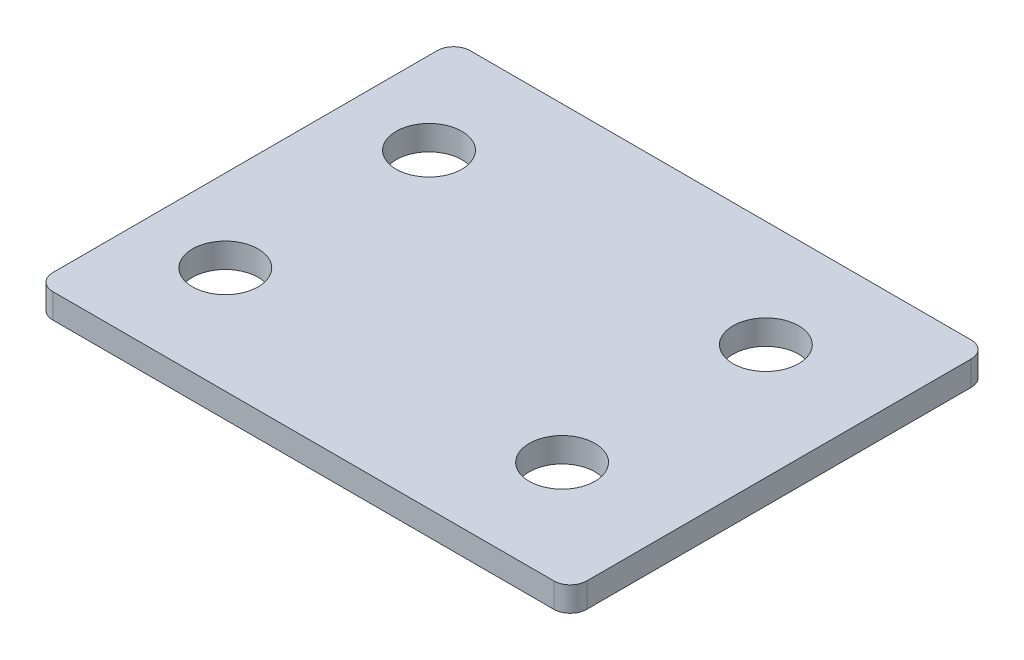
ISO-10303-21;
HEADER;
FILE_DESCRIPTION(('STEP AP214'),'2;1');
FILE_NAME('part.step','',(''),(''),'','','');
FILE_SCHEMA(('AUTOMOTIVE_DESIGN { 1 0 10303 214 1 1 1 1 }'));
ENDSEC;
DATA;
#1=APPLICATION_CONTEXT('core data for automotive mechanical design processes');
#2=APPLICATION_PROTOCOL_DEFINITION('international standard','automotive_design',2000,#1);
#3=PRODUCT_CONTEXT('',#1,'mechanical');
#4=PRODUCT('Part','Part','',(#3));
#5=PRODUCT_RELATED_PRODUCT_CATEGORY('part','',(#4));
#6=PRODUCT_DEFINITION_FORMATION('','',#4);
#7=PRODUCT_DEFINITION_CONTEXT('part definition',#1,'design');
#8=PRODUCT_DEFINITION('design','',#6,#7);
#9=PRODUCT_DEFINITION_SHAPE('','',#8);
#10=(LENGTH_UNIT() NAMED_UNIT(*) SI_UNIT(.MILLI.,.METRE.));
#11=(NAMED_UNIT(*) PLANE_ANGLE_UNIT() SI_UNIT($,.RADIAN.));
#12=(NAMED_UNIT(*) SI_UNIT($,.STERADIAN.) SOLID_ANGLE_UNIT());
#13=UNCERTAINTY_MEASURE_WITH_UNIT(LENGTH_MEASURE(1.E-05),#10,'distance_accuracy_value','');
#14=(GEOMETRIC_REPRESENTATION_CONTEXT(3) GLOBAL_UNCERTAINTY_ASSIGNED_CONTEXT((#13)) GLOBAL_UNIT_ASSIGNED_CONTEXT((#10,
#11,#12)) REPRESENTATION_CONTEXT('',''));
#15=CARTESIAN_POINT('',(0.,0.,0.));
#16=DIRECTION('',(0.,0.,1.));
#17=DIRECTION('',(1.,0.,0.));
#18=AXIS2_PLACEMENT_3D('',#15,#16,#17);
#19=CARTESIAN_POINT('',(-30.5,3.,23.4));
#20=DIRECTION('',(0.,1.,0.));
#21=DIRECTION('',(0.,0.,1.));
#22=AXIS2_PLACEMENT_3D('',#19,#20,#21);
#23=PLANE('',#22);
#24=CARTESIAN_POINT('',(-22.5,3.,12.4));
#25=DIRECTION('',(0.,1.,0.));
#26=DIRECTION('',(0.,0.,1.));
#27=AXIS2_PLACEMENT_3D('',#24,#25,#26);
#28=CIRCLE('',#27,4.);
#29=CARTESIAN_POINT('',(-22.5,3.,16.4));
#30=VERTEX_POINT('',#29);
#31=EDGE_CURVE('E188',#30,#30,#28,.T.);
#32=ORIENTED_EDGE('',*,*,#31,.F.);
#33=EDGE_LOOP('',(#32));
#34=FACE_BOUND('',#33,.T.);
#35=CARTESIAN_POINT('',(-22.5,3.,-12.4));
#36=DIRECTION('',(0.,1.,0.));
#37=DIRECTION('',(0.,0.,1.));
#38=AXIS2_PLACEMENT_3D('',#35,#36,#37);
#39=CIRCLE('',#38,4.);
#40=CARTESIAN_POINT('',(-22.5,3.,-8.4));
#41=VERTEX_POINT('',#40);
#42=EDGE_CURVE('E134',#41,#41,#39,.T.);
#43=ORIENTED_EDGE('',*,*,#42,.F.);
#44=EDGE_LOOP('',(#43));
#45=FACE_BOUND('',#44,.T.);
#46=CARTESIAN_POINT('',(-30.5,3.,23.4));
#47=DIRECTION('',(0.,1.,0.));
#48=DIRECTION('',(0.,0.,1.));
#49=AXIS2_PLACEMENT_3D('',#46,#47,#48);
#50=CIRCLE('',#49,2.);
#51=CARTESIAN_POINT('',(-32.5,3.,23.4));
#52=VERTEX_POINT('',#51);
#53=CARTESIAN_POINT('',(-30.5,3.,25.4));
#54=VERTEX_POINT('',#53);
#55=EDGE_CURVE('E145',#52,#54,#50,.T.);
#56=ORIENTED_EDGE('',*,*,#55,.T.);
#57=DIRECTION('',(1.,0.,0.));
#58=VECTOR('',#57,1.);
#59=CARTESIAN_POINT('',(-30.5,3.,25.4));
#60=LINE('',#59,#58);
#61=CARTESIAN_POINT('',(30.5,3.,25.4));
#62=VERTEX_POINT('',#61);
#63=EDGE_CURVE('E93',#54,#62,#60,.T.);
#64=ORIENTED_EDGE('',*,*,#63,.T.);
#65=CARTESIAN_POINT('',(30.5,3.,23.4));
#66=DIRECTION('',(0.,1.,0.));
#67=DIRECTION('',(0.,0.,1.));
#68=AXIS2_PLACEMENT_3D('',#65,#66,#67);
#69=CIRCLE('',#68,2.);
#70=CARTESIAN_POINT('',(32.5,3.,23.4));
#71=VERTEX_POINT('',#70);
#72=EDGE_CURVE('E160',#62,#71,#69,.T.);
#73=ORIENTED_EDGE('',*,*,#72,.T.);
#74=DIRECTION('',(0.,0.,-1.));
#75=VECTOR('',#74,1.);
#76=CARTESIAN_POINT('',(32.5,3.,23.4));
#77=LINE('',#76,#75);
#78=CARTESIAN_POINT('',(32.5,3.,-23.4));
#79=VERTEX_POINT('',#78);
#80=EDGE_CURVE('E173',#71,#79,#77,.T.);
#81=ORIENTED_EDGE('',*,*,#80,.T.);
#82=CARTESIAN_POINT('',(30.5,3.,-23.4));
#83=DIRECTION('',(0.,1.,0.));
#84=DIRECTION('',(0.,0.,1.));
#85=AXIS2_PLACEMENT_3D('',#82,#83,#84);
#86=CIRCLE('',#85,2.);
#87=CARTESIAN_POINT('',(30.5,3.,-25.4));
#88=VERTEX_POINT('',#87);
#89=EDGE_CURVE('E112',#79,#88,#86,.T.);
#90=ORIENTED_EDGE('',*,*,#89,.T.);
#91=DIRECTION('',(-1.,0.,0.));
#92=VECTOR('',#91,1.);
#93=CARTESIAN_POINT('',(-30.5,3.,-25.4));
#94=LINE('',#93,#92);
#95=CARTESIAN_POINT('',(-30.5,3.,-25.4));
#96=VERTEX_POINT('',#95);
#97=EDGE_CURVE('E106',#88,#96,#94,.T.);
#98=ORIENTED_EDGE('',*,*,#97,.T.);
#99=CARTESIAN_POINT('',(-30.5,3.,-23.4));
#100=DIRECTION('',(0.,1.,0.));
#101=DIRECTION('',(0.,0.,-1.));
#102=AXIS2_PLACEMENT_3D('',#99,#100,#101);
#103=CIRCLE('',#102,2.);
#104=CARTESIAN_POINT('',(-32.5,3.,-23.4));
#105=VERTEX_POINT('',#104);
#106=EDGE_CURVE('E110',#96,#105,#103,.T.);
#107=ORIENTED_EDGE('',*,*,#106,.T.);
#108=DIRECTION('',(0.,0.,1.));
#109=VECTOR('',#108,1.);
#110=CARTESIAN_POINT('',(-32.5,3.,23.4));
#111=LINE('',#110,#109);
#112=EDGE_CURVE('E50',#105,#52,#111,.T.);
#113=ORIENTED_EDGE('',*,*,#112,.T.);
#114=EDGE_LOOP('',(#56,#64,#73,#81,#90,#98,#107,#113));
#115=FACE_BOUND('',#114,.T.);
#116=CARTESIAN_POINT('',(18.5,3.,-12.4));
#117=DIRECTION('',(0.,1.,0.));
#118=DIRECTION('',(0.,0.,1.));
#119=AXIS2_PLACEMENT_3D('',#116,#117,#118);
#120=CIRCLE('',#119,4.);
#121=CARTESIAN_POINT('',(18.5,3.,-8.4));
#122=VERTEX_POINT('',#121);
#123=EDGE_CURVE('E182',#122,#122,#120,.T.);
#124=ORIENTED_EDGE('',*,*,#123,.F.);
#125=EDGE_LOOP('',(#124));
#126=FACE_BOUND('',#125,.T.);
#127=CARTESIAN_POINT('',(18.5,3.,12.4));
#128=DIRECTION('',(0.,1.,0.));
#129=DIRECTION('',(0.,0.,1.));
#130=AXIS2_PLACEMENT_3D('',#127,#128,#129);
#131=CIRCLE('',#130,4.);
#132=CARTESIAN_POINT('',(18.5,3.,16.4));
#133=VERTEX_POINT('',#132);
#134=EDGE_CURVE('E194',#133,#133,#131,.T.);
#135=ORIENTED_EDGE('',*,*,#134,.F.);
#136=EDGE_LOOP('',(#135));
#137=FACE_BOUND('',#136,.T.);
#138=ADVANCED_FACE('F33',(#34,#45,#115,#126,#137),#23,.T.);
#139=CARTESIAN_POINT('',(-30.5,0.,23.4));
#140=DIRECTION('',(0.,1.,0.));
#141=DIRECTION('',(0.,0.,1.));
#142=AXIS2_PLACEMENT_3D('',#139,#140,#141);
#143=PLANE('',#142);
#144=CARTESIAN_POINT('',(-30.5,0.,23.4));
#145=DIRECTION('',(0.,1.,0.));
#146=DIRECTION('',(0.,0.,1.));
#147=AXIS2_PLACEMENT_3D('',#144,#145,#146);
#148=CIRCLE('',#147,2.);
#149=CARTESIAN_POINT('',(-32.5,0.,23.4));
#150=VERTEX_POINT('',#149);
#151=CARTESIAN_POINT('',(-30.5,0.,25.4));
#152=VERTEX_POINT('',#151);
#153=EDGE_CURVE('E130',#150,#152,#148,.T.);
#154=ORIENTED_EDGE('',*,*,#153,.F.);
#155=DIRECTION('',(0.,0.,1.));
#156=VECTOR('',#155,1.);
#157=CARTESIAN_POINT('',(-32.5,0.,23.4));
#158=LINE('',#157,#156);
#159=CARTESIAN_POINT('',(-32.5,0.,-23.4));
#160=VERTEX_POINT('',#159);
#161=EDGE_CURVE('E85',#160,#150,#158,.T.);
#162=ORIENTED_EDGE('',*,*,#161,.F.);
#163=CARTESIAN_POINT('',(-30.5,0.,-23.4));
#164=DIRECTION('',(0.,1.,0.));
#165=DIRECTION('',(0.,0.,-1.));
#166=AXIS2_PLACEMENT_3D('',#163,#164,#165);
#167=CIRCLE('',#166,2.);
#168=CARTESIAN_POINT('',(-30.5,0.,-25.4));
#169=VERTEX_POINT('',#168);
#170=EDGE_CURVE('E79',#169,#160,#167,.T.);
#171=ORIENTED_EDGE('',*,*,#170,.F.);
#172=DIRECTION('',(-1.,0.,0.));
#173=VECTOR('',#172,1.);
#174=CARTESIAN_POINT('',(-30.5,0.,-25.4));
#175=LINE('',#174,#173);
#176=CARTESIAN_POINT('',(30.5,0.,-25.4));
#177=VERTEX_POINT('',#176);
#178=EDGE_CURVE('E120',#177,#169,#175,.T.);
#179=ORIENTED_EDGE('',*,*,#178,.F.);
#180=CARTESIAN_POINT('',(30.5,0.,-23.4));
#181=DIRECTION('',(0.,1.,0.));
#182=DIRECTION('',(0.,0.,1.));
#183=AXIS2_PLACEMENT_3D('',#180,#181,#182);
#184=CIRCLE('',#183,2.);
#185=CARTESIAN_POINT('',(32.5,0.,-23.4));
#186=VERTEX_POINT('',#185);
#187=EDGE_CURVE('E140',#186,#177,#184,.T.);
#188=ORIENTED_EDGE('',*,*,#187,.F.);
#189=DIRECTION('',(0.,0.,-1.));
#190=VECTOR('',#189,1.);
#191=CARTESIAN_POINT('',(32.5,0.,23.4));
#192=LINE('',#191,#190);
#193=CARTESIAN_POINT('',(32.5,0.,23.4));
#194=VERTEX_POINT('',#193);
#195=EDGE_CURVE('E138',#194,#186,#192,.T.);
#196=ORIENTED_EDGE('',*,*,#195,.F.);
#197=CARTESIAN_POINT('',(30.5,0.,23.4));
#198=DIRECTION('',(0.,1.,0.));
#199=DIRECTION('',(0.,0.,1.));
#200=AXIS2_PLACEMENT_3D('',#197,#198,#199);
#201=CIRCLE('',#200,2.);
#202=CARTESIAN_POINT('',(30.5,0.,25.4));
#203=VERTEX_POINT('',#202);
#204=EDGE_CURVE('E136',#203,#194,#201,.T.);
#205=ORIENTED_EDGE('',*,*,#204,.F.);
#206=DIRECTION('',(1.,0.,0.));
#207=VECTOR('',#206,1.);
#208=CARTESIAN_POINT('',(-30.5,0.,25.4));
#209=LINE('',#208,#207);
#210=EDGE_CURVE('E133',#152,#203,#209,.T.);
#211=ORIENTED_EDGE('',*,*,#210,.F.);
#212=EDGE_LOOP('',(#154,#162,#171,#179,#188,#196,#205,#211));
#213=FACE_BOUND('',#212,.T.);
#214=CARTESIAN_POINT('',(-22.5,0.,-12.4));
#215=DIRECTION('',(0.,1.,0.));
#216=DIRECTION('',(0.,0.,1.));
#217=AXIS2_PLACEMENT_3D('',#214,#215,#216);
#218=CIRCLE('',#217,4.);
#219=CARTESIAN_POINT('',(-22.5,0.,-8.4));
#220=VERTEX_POINT('',#219);
#221=EDGE_CURVE('E179',#220,#220,#218,.T.);
#222=ORIENTED_EDGE('',*,*,#221,.T.);
#223=EDGE_LOOP('',(#222));
#224=FACE_BOUND('',#223,.T.);
#225=CARTESIAN_POINT('',(18.5,0.,-12.4));
#226=DIRECTION('',(0.,1.,0.));
#227=DIRECTION('',(0.,0.,1.));
#228=AXIS2_PLACEMENT_3D('',#225,#226,#227);
#229=CIRCLE('',#228,4.);
#230=CARTESIAN_POINT('',(18.5,0.,-8.4));
#231=VERTEX_POINT('',#230);
#232=EDGE_CURVE('E185',#231,#231,#229,.T.);
#233=ORIENTED_EDGE('',*,*,#232,.T.);
#234=EDGE_LOOP('',(#233));
#235=FACE_BOUND('',#234,.T.);
#236=CARTESIAN_POINT('',(-22.5,0.,12.4));
#237=DIRECTION('',(0.,1.,0.));
#238=DIRECTION('',(0.,0.,1.));
#239=AXIS2_PLACEMENT_3D('',#236,#237,#238);
#240=CIRCLE('',#239,4.);
#241=CARTESIAN_POINT('',(-22.5,0.,16.4));
#242=VERTEX_POINT('',#241);
#243=EDGE_CURVE('E191',#242,#242,#240,.T.);
#244=ORIENTED_EDGE('',*,*,#243,.T.);
#245=EDGE_LOOP('',(#244));
#246=FACE_BOUND('',#245,.T.);
#247=CARTESIAN_POINT('',(18.5,0.,12.4));
#248=DIRECTION('',(0.,1.,0.));
#249=DIRECTION('',(0.,0.,1.));
#250=AXIS2_PLACEMENT_3D('',#247,#248,#249);
#251=CIRCLE('',#250,4.);
#252=CARTESIAN_POINT('',(18.5,0.,16.4));
#253=VERTEX_POINT('',#252);
#254=EDGE_CURVE('E197',#253,#253,#251,.T.);
#255=ORIENTED_EDGE('',*,*,#254,.T.);
#256=EDGE_LOOP('',(#255));
#257=FACE_BOUND('',#256,.T.);
#258=ADVANCED_FACE('F164',(#213,#224,#235,#246,#257),#143,.F.);
#259=CARTESIAN_POINT('',(-30.5,3.,23.4));
#260=DIRECTION('',(0.,-1.,0.));
#261=DIRECTION('',(0.,0.,-1.));
#262=AXIS2_PLACEMENT_3D('',#259,#260,#261);
#263=CYLINDRICAL_SURFACE('',#262,2.);
#264=ORIENTED_EDGE('',*,*,#153,.T.);
#265=DIRECTION('',(0.,-1.,0.));
#266=VECTOR('',#265,1.);
#267=CARTESIAN_POINT('',(-30.5,3.,25.4));
#268=LINE('',#267,#266);
#269=EDGE_CURVE('E11',#54,#152,#268,.T.);
#270=ORIENTED_EDGE('',*,*,#269,.F.);
#271=ORIENTED_EDGE('',*,*,#55,.F.);
#272=DIRECTION('',(0.,-1.,0.));
#273=VECTOR('',#272,1.);
#274=CARTESIAN_POINT('',(-32.5,3.,23.4));
#275=LINE('',#274,#273);
#276=EDGE_CURVE('E126',#52,#150,#275,.T.);
#277=ORIENTED_EDGE('',*,*,#276,.T.);
#278=EDGE_LOOP('',(#264,#270,#271,#277));
#279=FACE_BOUND('',#278,.T.);
#280=ADVANCED_FACE('F35',(#279),#263,.T.);
#281=CARTESIAN_POINT('',(-30.5,3.,25.4));
#282=DIRECTION('',(0.,0.,-1.));
#283=DIRECTION('',(-1.,0.,0.));
#284=AXIS2_PLACEMENT_3D('',#281,#282,#283);
#285=PLANE('',#284);
#286=ORIENTED_EDGE('',*,*,#210,.T.);
#287=DIRECTION('',(0.,-1.,0.));
#288=VECTOR('',#287,1.);
#289=CARTESIAN_POINT('',(30.5,3.,25.4));
#290=LINE('',#289,#288);
#291=EDGE_CURVE('E42',#62,#203,#290,.T.);
#292=ORIENTED_EDGE('',*,*,#291,.F.);
#293=ORIENTED_EDGE('',*,*,#63,.F.);
#294=ORIENTED_EDGE('',*,*,#269,.T.);
#295=EDGE_LOOP('',(#286,#292,#293,#294));
#296=FACE_BOUND('',#295,.T.);
#297=ADVANCED_FACE('F231',(#296),#285,.F.);
#298=CARTESIAN_POINT('',(30.5,3.,23.4));
#299=DIRECTION('',(0.,-1.,0.));
#300=DIRECTION('',(0.,0.,-1.));
#301=AXIS2_PLACEMENT_3D('',#298,#299,#300);
#302=CYLINDRICAL_SURFACE('',#301,2.);
#303=ORIENTED_EDGE('',*,*,#204,.T.);
#304=DIRECTION('',(0.,-1.,0.));
#305=VECTOR('',#304,1.);
#306=CARTESIAN_POINT('',(32.5,3.,23.4));
#307=LINE('',#306,#305);
#308=EDGE_CURVE('E152',#71,#194,#307,.T.);
#309=ORIENTED_EDGE('',*,*,#308,.F.);
#310=ORIENTED_EDGE('',*,*,#72,.F.);
#311=ORIENTED_EDGE('',*,*,#291,.T.);
#312=EDGE_LOOP('',(#303,#309,#310,#311));
#313=FACE_BOUND('',#312,.T.);
#314=ADVANCED_FACE('F158',(#313),#302,.T.);
#315=CARTESIAN_POINT('',(32.5,3.,23.4));
#316=DIRECTION('',(-1.,0.,0.));
#317=DIRECTION('',(0.,0.,1.));
#318=AXIS2_PLACEMENT_3D('',#315,#316,#317);
#319=PLANE('',#318);
#320=ORIENTED_EDGE('',*,*,#195,.T.);
#321=DIRECTION('',(0.,-1.,0.));
#322=VECTOR('',#321,1.);
#323=CARTESIAN_POINT('',(32.5,3.,-23.4));
#324=LINE('',#323,#322);
#325=EDGE_CURVE('E149',#79,#186,#324,.T.);
#326=ORIENTED_EDGE('',*,*,#325,.F.);
#327=ORIENTED_EDGE('',*,*,#80,.F.);
#328=ORIENTED_EDGE('',*,*,#308,.T.);
#329=EDGE_LOOP('',(#320,#326,#327,#328));
#330=FACE_BOUND('',#329,.T.);
#331=ADVANCED_FACE('F169',(#330),#319,.F.);
#332=CARTESIAN_POINT('',(30.5,3.,-23.4));
#333=DIRECTION('',(0.,-1.,0.));
#334=DIRECTION('',(0.,0.,-1.));
#335=AXIS2_PLACEMENT_3D('',#332,#333,#334);
#336=CYLINDRICAL_SURFACE('',#335,2.);
#337=ORIENTED_EDGE('',*,*,#187,.T.);
#338=DIRECTION('',(0.,-1.,0.));
#339=VECTOR('',#338,1.);
#340=CARTESIAN_POINT('',(30.5,3.,-25.4));
#341=LINE('',#340,#339);
#342=EDGE_CURVE('E121',#88,#177,#341,.T.);
#343=ORIENTED_EDGE('',*,*,#342,.F.);
#344=ORIENTED_EDGE('',*,*,#89,.F.);
#345=ORIENTED_EDGE('',*,*,#325,.T.);
#346=EDGE_LOOP('',(#337,#343,#344,#345));
#347=FACE_BOUND('',#346,.T.);
#348=ADVANCED_FACE('F172',(#347),#336,.T.);
#349=CARTESIAN_POINT('',(-30.5,3.,-25.4));
#350=DIRECTION('',(0.,0.,1.));
#351=DIRECTION('',(1.,0.,0.));
#352=AXIS2_PLACEMENT_3D('',#349,#350,#351);
#353=PLANE('',#352);
#354=ORIENTED_EDGE('',*,*,#178,.T.);
#355=DIRECTION('',(0.,-1.,0.));
#356=VECTOR('',#355,1.);
#357=CARTESIAN_POINT('',(-30.5,3.,-25.4));
#358=LINE('',#357,#356);
#359=EDGE_CURVE('E117',#96,#169,#358,.T.);
#360=ORIENTED_EDGE('',*,*,#359,.F.);
#361=ORIENTED_EDGE('',*,*,#97,.F.);
#362=ORIENTED_EDGE('',*,*,#342,.T.);
#363=EDGE_LOOP('',(#354,#360,#361,#362));
#364=FACE_BOUND('',#363,.T.);
#365=ADVANCED_FACE('F118',(#364),#353,.F.);
#366=CARTESIAN_POINT('',(-30.5,3.,-23.4));
#367=DIRECTION('',(0.,-1.,0.));
#368=DIRECTION('',(0.,0.,-1.));
#369=AXIS2_PLACEMENT_3D('',#366,#367,#368);
#370=CYLINDRICAL_SURFACE('',#369,2.);
#371=ORIENTED_EDGE('',*,*,#170,.T.);
#372=DIRECTION('',(0.,-1.,0.));
#373=VECTOR('',#372,1.);
#374=CARTESIAN_POINT('',(-32.5,3.,-23.4));
#375=LINE('',#374,#373);
#376=EDGE_CURVE('E122',#105,#160,#375,.T.);
#377=ORIENTED_EDGE('',*,*,#376,.F.);
#378=ORIENTED_EDGE('',*,*,#106,.F.);
#379=ORIENTED_EDGE('',*,*,#359,.T.);
#380=EDGE_LOOP('',(#371,#377,#378,#379));
#381=FACE_BOUND('',#380,.T.);
#382=ADVANCED_FACE('F124',(#381),#370,.T.);
#383=CARTESIAN_POINT('',(-32.5,3.,23.4));
#384=DIRECTION('',(1.,0.,0.));
#385=DIRECTION('',(0.,0.,-1.));
#386=AXIS2_PLACEMENT_3D('',#383,#384,#385);
#387=PLANE('',#386);
#388=ORIENTED_EDGE('',*,*,#161,.T.);
#389=ORIENTED_EDGE('',*,*,#276,.F.);
#390=ORIENTED_EDGE('',*,*,#112,.F.);
#391=ORIENTED_EDGE('',*,*,#376,.T.);
#392=EDGE_LOOP('',(#388,#389,#390,#391));
#393=FACE_BOUND('',#392,.T.);
#394=ADVANCED_FACE('F219',(#393),#387,.F.);
#395=CARTESIAN_POINT('',(-22.5,3.,-12.4));
#396=DIRECTION('',(0.,-1.,0.));
#397=DIRECTION('',(0.,0.,-1.));
#398=AXIS2_PLACEMENT_3D('',#395,#396,#397);
#399=CYLINDRICAL_SURFACE('',#398,4.);
#400=ORIENTED_EDGE('',*,*,#42,.T.);
#401=EDGE_LOOP('',(#400));
#402=FACE_BOUND('',#401,.T.);
#403=ORIENTED_EDGE('',*,*,#221,.F.);
#404=EDGE_LOOP('',(#403));
#405=FACE_BOUND('',#404,.T.);
#406=ADVANCED_FACE('F216',(#402,#405),#399,.F.);
#407=CARTESIAN_POINT('',(18.5,3.,-12.4));
#408=DIRECTION('',(0.,-1.,0.));
#409=DIRECTION('',(0.,0.,-1.));
#410=AXIS2_PLACEMENT_3D('',#407,#408,#409);
#411=CYLINDRICAL_SURFACE('',#410,4.);
#412=ORIENTED_EDGE('',*,*,#123,.T.);
#413=EDGE_LOOP('',(#412));
#414=FACE_BOUND('',#413,.T.);
#415=ORIENTED_EDGE('',*,*,#232,.F.);
#416=EDGE_LOOP('',(#415));
#417=FACE_BOUND('',#416,.T.);
#418=ADVANCED_FACE('F295',(#414,#417),#411,.F.);
#419=CARTESIAN_POINT('',(-22.5,3.,12.4));
#420=DIRECTION('',(0.,-1.,0.));
#421=DIRECTION('',(0.,0.,-1.));
#422=AXIS2_PLACEMENT_3D('',#419,#420,#421);
#423=CYLINDRICAL_SURFACE('',#422,4.);
#424=ORIENTED_EDGE('',*,*,#31,.T.);
#425=EDGE_LOOP('',(#424));
#426=FACE_BOUND('',#425,.T.);
#427=ORIENTED_EDGE('',*,*,#243,.F.);
#428=EDGE_LOOP('',(#427));
#429=FACE_BOUND('',#428,.T.);
#430=ADVANCED_FACE('F303',(#426,#429),#423,.F.);
#431=CARTESIAN_POINT('',(18.5,3.,12.4));
#432=DIRECTION('',(0.,-1.,0.));
#433=DIRECTION('',(0.,0.,-1.));
#434=AXIS2_PLACEMENT_3D('',#431,#432,#433);
#435=CYLINDRICAL_SURFACE('',#434,4.);
#436=ORIENTED_EDGE('',*,*,#134,.T.);
#437=EDGE_LOOP('',(#436));
#438=FACE_BOUND('',#437,.T.);
#439=ORIENTED_EDGE('',*,*,#254,.F.);
#440=EDGE_LOOP('',(#439));
#441=FACE_BOUND('',#440,.T.);
#442=ADVANCED_FACE('F203',(#438,#441),#435,.F.);
#443=CLOSED_SHELL('',(#138,#258,#280,#297,#314,#331,#348,#365,#382,#394,#406,#418,#430,#442));
#444=MANIFOLD_SOLID_BREP('B2',#443);
#445=ADVANCED_BREP_SHAPE_REPRESENTATION('',(#18,#444),#14);
#446=SHAPE_DEFINITION_REPRESENTATION(#9,#445);
ENDSEC;
END-ISO-10303-21;
